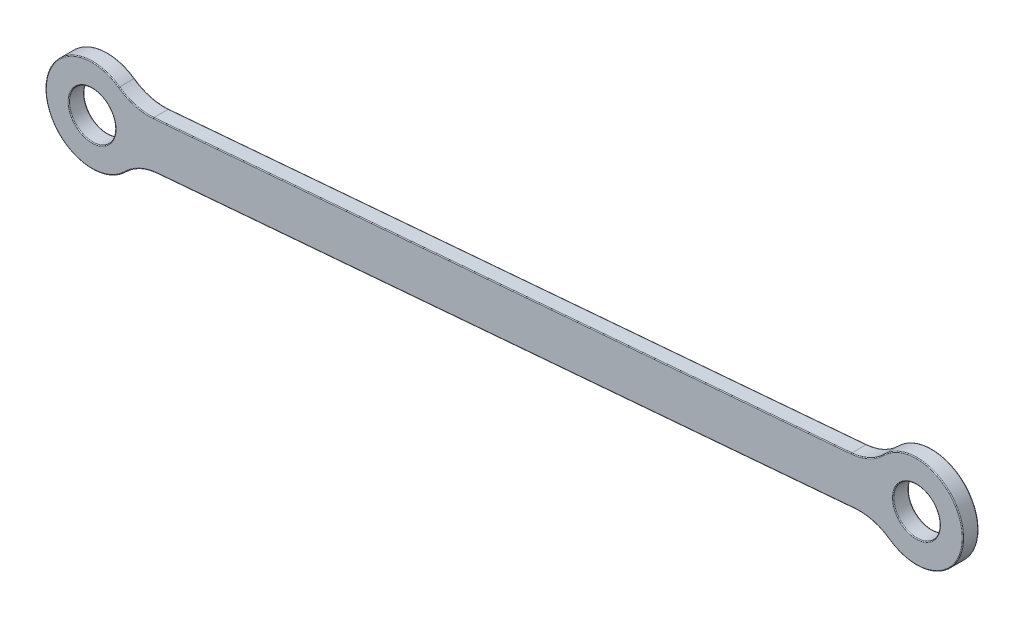
ISO-10303-21;
HEADER;
FILE_DESCRIPTION(('STEP AP214'),'2;1');
FILE_NAME('part.step','',(''),(''),'','','');
FILE_SCHEMA(('AUTOMOTIVE_DESIGN { 1 0 10303 214 1 1 1 1 }'));
ENDSEC;
DATA;
#1=APPLICATION_CONTEXT('core data for automotive mechanical design processes');
#2=APPLICATION_PROTOCOL_DEFINITION('international standard','automotive_design',2000,#1);
#3=PRODUCT_CONTEXT('',#1,'mechanical');
#4=PRODUCT('Part','Part','',(#3));
#5=PRODUCT_RELATED_PRODUCT_CATEGORY('part','',(#4));
#6=PRODUCT_DEFINITION_FORMATION('','',#4);
#7=PRODUCT_DEFINITION_CONTEXT('part definition',#1,'design');
#8=PRODUCT_DEFINITION('design','',#6,#7);
#9=PRODUCT_DEFINITION_SHAPE('','',#8);
#10=(LENGTH_UNIT() NAMED_UNIT(*) SI_UNIT(.MILLI.,.METRE.));
#11=(NAMED_UNIT(*) PLANE_ANGLE_UNIT() SI_UNIT($,.RADIAN.));
#12=(NAMED_UNIT(*) SI_UNIT($,.STERADIAN.) SOLID_ANGLE_UNIT());
#13=UNCERTAINTY_MEASURE_WITH_UNIT(LENGTH_MEASURE(1.E-05),#10,'distance_accuracy_value','');
#14=(GEOMETRIC_REPRESENTATION_CONTEXT(3) GLOBAL_UNCERTAINTY_ASSIGNED_CONTEXT((#13)) GLOBAL_UNIT_ASSIGNED_CONTEXT((#10,
#11,#12)) REPRESENTATION_CONTEXT('',''));
#15=CARTESIAN_POINT('',(0.,0.,0.));
#16=DIRECTION('',(0.,0.,1.));
#17=DIRECTION('',(1.,0.,0.));
#18=AXIS2_PLACEMENT_3D('',#15,#16,#17);
#19=CARTESIAN_POINT('',(-86.9250550920699,226.277353864385,3.));
#20=DIRECTION('',(0.,0.,-1.));
#21=DIRECTION('',(-1.,0.,0.));
#22=AXIS2_PLACEMENT_3D('',#19,#20,#21);
#23=CYLINDRICAL_SURFACE('',#22,9.);
#24=DIRECTION('',(0.,0.,-1.));
#25=VECTOR('',#24,1.);
#26=CARTESIAN_POINT('',(-92.146757938512,218.947018307027,3.));
#27=LINE('',#26,#25);
#28=CARTESIAN_POINT('',(-92.146757938512,218.947018307027,2.85));
#29=VERTEX_POINT('',#28);
#30=CARTESIAN_POINT('',(-92.146757938512,218.947018307027,0.15));
#31=VERTEX_POINT('',#30);
#32=EDGE_CURVE('E306',#29,#31,#27,.T.);
#33=ORIENTED_EDGE('',*,*,#32,.T.);
#34=CARTESIAN_POINT('',(-86.9250550920699,226.277353864385,0.15));
#35=DIRECTION('',(0.,0.,1.));
#36=DIRECTION('',(1.,0.,0.));
#37=AXIS2_PLACEMENT_3D('',#34,#35,#36);
#38=CIRCLE('',#37,9.);
#39=CARTESIAN_POINT('',(-93.2944978018195,232.635828490207,0.15));
#40=VERTEX_POINT('',#39);
#41=EDGE_CURVE('E221',#31,#40,#38,.T.);
#42=ORIENTED_EDGE('',*,*,#41,.T.);
#43=DIRECTION('',(0.,0.,-1.));
#44=VECTOR('',#43,1.);
#45=CARTESIAN_POINT('',(-93.2944978018195,232.635828490207,3.));
#46=LINE('',#45,#44);
#47=CARTESIAN_POINT('',(-93.2944978018195,232.635828490207,2.85));
#48=VERTEX_POINT('',#47);
#49=EDGE_CURVE('E300',#40,#48,#46,.F.);
#50=ORIENTED_EDGE('',*,*,#49,.T.);
#51=CARTESIAN_POINT('',(-86.9250550920699,226.277353864385,2.85));
#52=DIRECTION('',(0.,0.,1.));
#53=DIRECTION('',(1.,0.,0.));
#54=AXIS2_PLACEMENT_3D('',#51,#52,#53);
#55=CIRCLE('',#54,9.);
#56=EDGE_CURVE('E219',#48,#29,#55,.F.);
#57=ORIENTED_EDGE('',*,*,#56,.T.);
#58=EDGE_LOOP('',(#33,#42,#50,#57));
#59=FACE_BOUND('',#58,.T.);
#60=ADVANCED_FACE('F35',(#59),#23,.T.);
#61=CARTESIAN_POINT('',(-19.8226080841096,236.419356052479,3.));
#62=DIRECTION('',(-0.0835519440721957,0.996503423296557,0.));
#63=DIRECTION('',(-0.996503423296557,-0.0835519440721958,0.));
#64=AXIS2_PLACEMENT_3D('',#61,#62,#63);
#65=PLANE('',#64);
#66=DIRECTION('',(0.,0.,-1.));
#67=VECTOR('',#66,1.);
#68=CARTESIAN_POINT('',(-99.536136927486,229.735766063709,3.));
#69=LINE('',#68,#67);
#70=CARTESIAN_POINT('',(-99.536136927486,229.735766063709,2.85));
#71=VERTEX_POINT('',#70);
#72=CARTESIAN_POINT('',(-99.536136927486,229.735766063709,0.15));
#73=VERTEX_POINT('',#72);
#74=EDGE_CURVE('E302',#71,#73,#69,.T.);
#75=ORIENTED_EDGE('',*,*,#74,.T.);
#76=DIRECTION('',(0.996503423296557,0.0835519440721958,0.));
#77=VECTOR('',#76,1.);
#78=CARTESIAN_POINT('',(-234.506488480753,218.419161423178,0.15));
#79=LINE('',#78,#77);
#80=CARTESIAN_POINT('',(-234.506488480753,218.419161423178,0.15));
#81=VERTEX_POINT('',#80);
#82=EDGE_CURVE('E196',#73,#81,#79,.F.);
#83=ORIENTED_EDGE('',*,*,#82,.T.);
#84=DIRECTION('',(0.,0.,-1.));
#85=VECTOR('',#84,1.);
#86=CARTESIAN_POINT('',(-234.506488480753,218.419161423178,3.));
#87=LINE('',#86,#85);
#88=CARTESIAN_POINT('',(-234.506488480753,218.419161423178,2.85));
#89=VERTEX_POINT('',#88);
#90=EDGE_CURVE('E338',#81,#89,#87,.F.);
#91=ORIENTED_EDGE('',*,*,#90,.T.);
#92=DIRECTION('',(0.996503423296557,0.0835519440721958,0.));
#93=VECTOR('',#92,1.);
#94=CARTESIAN_POINT('',(-19.8226080841096,236.419356052479,2.85));
#95=LINE('',#94,#93);
#96=EDGE_CURVE('E194',#89,#71,#95,.T.);
#97=ORIENTED_EDGE('',*,*,#96,.T.);
#98=EDGE_LOOP('',(#75,#83,#91,#97));
#99=FACE_BOUND('',#98,.T.);
#100=ADVANCED_FACE('F337',(#99),#65,.T.);
#101=CARTESIAN_POINT('',(-246.365602819519,212.909042812834,3.));
#102=DIRECTION('',(0.,0.,-1.));
#103=DIRECTION('',(-1.,0.,0.));
#104=AXIS2_PLACEMENT_3D('',#101,#102,#103);
#105=CYLINDRICAL_SURFACE('',#104,9.00000000000001);
#106=DIRECTION('',(0.,0.,-1.));
#107=VECTOR('',#106,1.);
#108=CARTESIAN_POINT('',(-241.143899973077,220.239378370191,3.));
#109=LINE('',#108,#107);
#110=CARTESIAN_POINT('',(-241.143899973077,220.239378370191,2.85));
#111=VERTEX_POINT('',#110);
#112=CARTESIAN_POINT('',(-241.143899973077,220.239378370191,0.15));
#113=VERTEX_POINT('',#112);
#114=EDGE_CURVE('E262',#111,#113,#109,.T.);
#115=ORIENTED_EDGE('',*,*,#114,.T.);
#116=CARTESIAN_POINT('',(-246.365602819519,212.909042812834,0.15));
#117=DIRECTION('',(0.,0.,1.));
#118=DIRECTION('',(1.,0.,0.));
#119=AXIS2_PLACEMENT_3D('',#116,#117,#118);
#120=CIRCLE('',#119,9.00000000000001);
#121=CARTESIAN_POINT('',(-239.996160109769,206.550568187012,0.15));
#122=VERTEX_POINT('',#121);
#123=EDGE_CURVE('E204',#113,#122,#120,.T.);
#124=ORIENTED_EDGE('',*,*,#123,.T.);
#125=DIRECTION('',(0.,0.,-1.));
#126=VECTOR('',#125,1.);
#127=CARTESIAN_POINT('',(-239.996160109769,206.550568187012,3.));
#128=LINE('',#127,#126);
#129=CARTESIAN_POINT('',(-239.996160109769,206.550568187012,2.85));
#130=VERTEX_POINT('',#129);
#131=EDGE_CURVE('E310',#122,#130,#128,.F.);
#132=ORIENTED_EDGE('',*,*,#131,.T.);
#133=CARTESIAN_POINT('',(-246.365602819519,212.909042812834,2.85));
#134=DIRECTION('',(0.,0.,1.));
#135=DIRECTION('',(1.,0.,0.));
#136=AXIS2_PLACEMENT_3D('',#133,#134,#135);
#137=CIRCLE('',#136,9.00000000000001);
#138=EDGE_CURVE('E202',#130,#111,#137,.F.);
#139=ORIENTED_EDGE('',*,*,#138,.T.);
#140=EDGE_LOOP('',(#115,#124,#132,#139));
#141=FACE_BOUND('',#140,.T.);
#142=ADVANCED_FACE('F349',(#141),#105,.T.);
#143=CARTESIAN_POINT('',(-19.0706405874598,227.45082524281,3.));
#144=DIRECTION('',(-0.0835519440721957,0.996503423296557,0.));
#145=DIRECTION('',(-0.996503423296557,-0.0835519440721957,0.));
#146=AXIS2_PLACEMENT_3D('',#143,#144,#145);
#147=PLANE('',#146);
#148=DIRECTION('',(0.,0.,1.));
#149=VECTOR('',#148,1.);
#150=CARTESIAN_POINT('',(-233.754520984103,209.450630613509,0.));
#151=LINE('',#150,#149);
#152=CARTESIAN_POINT('',(-233.754520984103,209.450630613509,2.85));
#153=VERTEX_POINT('',#152);
#154=CARTESIAN_POINT('',(-233.754520984103,209.450630613509,0.15));
#155=VERTEX_POINT('',#154);
#156=EDGE_CURVE('E340',#153,#155,#151,.F.);
#157=ORIENTED_EDGE('',*,*,#156,.T.);
#158=DIRECTION('',(0.996503423296557,0.0835519440721957,0.));
#159=VECTOR('',#158,1.);
#160=CARTESIAN_POINT('',(-19.0706405874598,227.45082524281,0.15));
#161=LINE('',#160,#159);
#162=CARTESIAN_POINT('',(-98.7841694308362,220.76723525404,0.15));
#163=VERTEX_POINT('',#162);
#164=EDGE_CURVE('E213',#155,#163,#161,.T.);
#165=ORIENTED_EDGE('',*,*,#164,.T.);
#166=DIRECTION('',(0.,0.,1.));
#167=VECTOR('',#166,1.);
#168=CARTESIAN_POINT('',(-98.7841694308362,220.76723525404,3.));
#169=LINE('',#168,#167);
#170=CARTESIAN_POINT('',(-98.7841694308362,220.76723525404,2.85));
#171=VERTEX_POINT('',#170);
#172=EDGE_CURVE('E308',#163,#171,#169,.T.);
#173=ORIENTED_EDGE('',*,*,#172,.T.);
#174=DIRECTION('',(0.996503423296557,0.0835519440721957,0.));
#175=VECTOR('',#174,1.);
#176=CARTESIAN_POINT('',(-233.754520984103,209.450630613509,2.85));
#177=LINE('',#176,#175);
#178=EDGE_CURVE('E211',#171,#153,#177,.F.);
#179=ORIENTED_EDGE('',*,*,#178,.T.);
#180=EDGE_LOOP('',(#157,#165,#173,#179));
#181=FACE_BOUND('',#180,.T.);
#182=ADVANCED_FACE('F389',(#181),#147,.F.);
#183=CARTESIAN_POINT('',(-86.9250550920699,226.277353864385,3.));
#184=DIRECTION('',(0.,0.,-1.));
#185=DIRECTION('',(-1.,0.,0.));
#186=AXIS2_PLACEMENT_3D('',#183,#184,#185);
#187=CYLINDRICAL_SURFACE('',#186,4.50000000000002);
#188=CARTESIAN_POINT('',(-86.9250550920699,226.277353864385,0.15));
#189=DIRECTION('',(0.,0.,1.));
#190=DIRECTION('',(1.,0.,0.));
#191=AXIS2_PLACEMENT_3D('',#188,#189,#190);
#192=CIRCLE('',#191,4.50000000000002);
#193=CARTESIAN_POINT('',(-82.4250550920699,226.277353864385,0.15));
#194=VERTEX_POINT('',#193);
#195=EDGE_CURVE('E226',#194,#194,#192,.F.);
#196=ORIENTED_EDGE('',*,*,#195,.T.);
#197=EDGE_LOOP('',(#196));
#198=FACE_BOUND('',#197,.T.);
#199=CARTESIAN_POINT('',(-86.9250550920699,226.277353864385,2.85));
#200=DIRECTION('',(0.,0.,1.));
#201=DIRECTION('',(1.,0.,0.));
#202=AXIS2_PLACEMENT_3D('',#199,#200,#201);
#203=CIRCLE('',#202,4.50000000000002);
#204=CARTESIAN_POINT('',(-82.4250550920699,226.277353864385,2.85));
#205=VERTEX_POINT('',#204);
#206=EDGE_CURVE('E223',#205,#205,#203,.T.);
#207=ORIENTED_EDGE('',*,*,#206,.T.);
#208=EDGE_LOOP('',(#207));
#209=FACE_BOUND('',#208,.T.);
#210=ADVANCED_FACE('F385',(#198,#209),#187,.F.);
#211=CARTESIAN_POINT('',(-246.365602819519,212.909042812834,3.));
#212=DIRECTION('',(0.,0.,-1.));
#213=DIRECTION('',(-1.,0.,0.));
#214=AXIS2_PLACEMENT_3D('',#211,#212,#213);
#215=CYLINDRICAL_SURFACE('',#214,4.50000000000004);
#216=CARTESIAN_POINT('',(-246.365602819519,212.909042812834,0.15));
#217=DIRECTION('',(0.,0.,1.));
#218=DIRECTION('',(1.,0.,0.));
#219=AXIS2_PLACEMENT_3D('',#216,#217,#218);
#220=CIRCLE('',#219,4.50000000000004);
#221=CARTESIAN_POINT('',(-241.865602819519,212.909042812834,0.15));
#222=VERTEX_POINT('',#221);
#223=EDGE_CURVE('E188',#222,#222,#220,.F.);
#224=ORIENTED_EDGE('',*,*,#223,.T.);
#225=EDGE_LOOP('',(#224));
#226=FACE_BOUND('',#225,.T.);
#227=CARTESIAN_POINT('',(-246.365602819519,212.909042812834,2.85));
#228=DIRECTION('',(0.,0.,1.));
#229=DIRECTION('',(1.,0.,0.));
#230=AXIS2_PLACEMENT_3D('',#227,#228,#229);
#231=CIRCLE('',#230,4.50000000000004);
#232=CARTESIAN_POINT('',(-241.865602819519,212.909042812834,2.85));
#233=VERTEX_POINT('',#232);
#234=EDGE_CURVE('E180',#233,#233,#231,.T.);
#235=ORIENTED_EDGE('',*,*,#234,.T.);
#236=EDGE_LOOP('',(#235));
#237=FACE_BOUND('',#236,.T.);
#238=ADVANCED_FACE('F388',(#226,#237),#215,.F.);
#239=CARTESIAN_POINT('',(0.,0.,3.));
#240=DIRECTION('',(0.,0.,1.));
#241=DIRECTION('',(1.,0.,0.));
#242=AXIS2_PLACEMENT_3D('',#239,#240,#241);
#243=PLANE('',#242);
#244=CARTESIAN_POINT('',(-246.365602819519,212.909042812834,3.));
#245=DIRECTION('',(0.,0.,1.));
#246=DIRECTION('',(1.,0.,0.));
#247=AXIS2_PLACEMENT_3D('',#244,#245,#246);
#248=CIRCLE('',#247,4.65000000000004);
#249=CARTESIAN_POINT('',(-241.715602819519,212.909042812834,3.));
#250=VERTEX_POINT('',#249);
#251=EDGE_CURVE('E11',#250,#250,#248,.F.);
#252=ORIENTED_EDGE('',*,*,#251,.T.);
#253=EDGE_LOOP('',(#252));
#254=FACE_BOUND('',#253,.T.);
#255=CARTESIAN_POINT('',(-246.365602819519,212.909042812834,3.));
#256=DIRECTION('',(0.,0.,1.));
#257=DIRECTION('',(1.,0.,0.));
#258=AXIS2_PLACEMENT_3D('',#255,#256,#257);
#259=CIRCLE('',#258,8.85000000000001);
#260=CARTESIAN_POINT('',(-241.230928353851,220.117206110902,3.));
#261=VERTEX_POINT('',#260);
#262=CARTESIAN_POINT('',(-240.102317488265,206.656542764109,3.));
#263=VERTEX_POINT('',#262);
#264=EDGE_CURVE('E52',#261,#263,#259,.T.);
#265=ORIENTED_EDGE('',*,*,#264,.T.);
#266=CARTESIAN_POINT('',(-232.919001543381,199.485596380543,3.));
#267=DIRECTION('',(0.,0.,1.));
#268=DIRECTION('',(1.,0.,0.));
#269=AXIS2_PLACEMENT_3D('',#266,#267,#268);
#270=CIRCLE('',#269,10.15);
#271=CARTESIAN_POINT('',(-233.767053775714,209.600106127004,3.));
#272=VERTEX_POINT('',#271);
#273=EDGE_CURVE('E44',#263,#272,#270,.F.);
#274=ORIENTED_EDGE('',*,*,#273,.T.);
#275=DIRECTION('',(0.996503423296557,0.0835519440721957,0.));
#276=VECTOR('',#275,1.);
#277=CARTESIAN_POINT('',(-98.7967022224471,220.916710767535,3.));
#278=LINE('',#277,#276);
#279=CARTESIAN_POINT('',(-98.7967022224471,220.916710767535,3.));
#280=VERTEX_POINT('',#279);
#281=EDGE_CURVE('E232',#272,#280,#278,.T.);
#282=ORIENTED_EDGE('',*,*,#281,.T.);
#283=CARTESIAN_POINT('',(-97.9486499901143,210.802201021075,3.));
#284=DIRECTION('',(0.,0.,1.));
#285=DIRECTION('',(1.,0.,0.));
#286=AXIS2_PLACEMENT_3D('',#283,#284,#285);
#287=CIRCLE('',#286,10.15);
#288=CARTESIAN_POINT('',(-92.0597295577379,219.069190566317,3.));
#289=VERTEX_POINT('',#288);
#290=EDGE_CURVE('E234',#280,#289,#287,.F.);
#291=ORIENTED_EDGE('',*,*,#290,.T.);
#292=CARTESIAN_POINT('',(-86.9250550920699,226.277353864385,3.));
#293=DIRECTION('',(0.,0.,1.));
#294=DIRECTION('',(1.,0.,0.));
#295=AXIS2_PLACEMENT_3D('',#292,#293,#294);
#296=CIRCLE('',#295,8.85);
#297=CARTESIAN_POINT('',(-93.1883404233236,232.52985391311,3.));
#298=VERTEX_POINT('',#297);
#299=EDGE_CURVE('E236',#289,#298,#296,.T.);
#300=ORIENTED_EDGE('',*,*,#299,.T.);
#301=CARTESIAN_POINT('',(-100.371656368208,239.700800296675,3.));
#302=DIRECTION('',(0.,0.,1.));
#303=DIRECTION('',(1.,0.,0.));
#304=AXIS2_PLACEMENT_3D('',#301,#302,#303);
#305=CIRCLE('',#304,10.15);
#306=CARTESIAN_POINT('',(-99.5236041358751,229.586290550215,3.));
#307=VERTEX_POINT('',#306);
#308=EDGE_CURVE('E238',#298,#307,#305,.F.);
#309=ORIENTED_EDGE('',*,*,#308,.T.);
#310=DIRECTION('',(0.996503423296557,0.0835519440721958,0.));
#311=VECTOR('',#310,1.);
#312=CARTESIAN_POINT('',(-19.8100752924988,236.269880538984,3.));
#313=LINE('',#312,#311);
#314=CARTESIAN_POINT('',(-234.493955689142,218.269685909684,3.));
#315=VERTEX_POINT('',#314);
#316=EDGE_CURVE('E240',#307,#315,#313,.F.);
#317=ORIENTED_EDGE('',*,*,#316,.T.);
#318=CARTESIAN_POINT('',(-235.342007921475,228.384195656144,3.));
#319=DIRECTION('',(0.,0.,1.));
#320=DIRECTION('',(1.,0.,0.));
#321=AXIS2_PLACEMENT_3D('',#318,#319,#320);
#322=CIRCLE('',#321,10.15);
#323=EDGE_CURVE('E57',#315,#261,#322,.F.);
#324=ORIENTED_EDGE('',*,*,#323,.T.);
#325=EDGE_LOOP('',(#265,#274,#282,#291,#300,#309,#317,#324));
#326=FACE_BOUND('',#325,.T.);
#327=CARTESIAN_POINT('',(-86.9250550920699,226.277353864385,3.));
#328=DIRECTION('',(0.,0.,1.));
#329=DIRECTION('',(1.,0.,0.));
#330=AXIS2_PLACEMENT_3D('',#327,#328,#329);
#331=CIRCLE('',#330,4.65000000000002);
#332=CARTESIAN_POINT('',(-82.2750550920699,226.277353864385,3.));
#333=VERTEX_POINT('',#332);
#334=EDGE_CURVE('E229',#333,#333,#331,.F.);
#335=ORIENTED_EDGE('',*,*,#334,.T.);
#336=EDGE_LOOP('',(#335));
#337=FACE_BOUND('',#336,.T.);
#338=ADVANCED_FACE('F594',(#254,#326,#337),#243,.T.);
#339=CARTESIAN_POINT('',(0.,0.,0.));
#340=DIRECTION('',(0.,0.,1.));
#341=DIRECTION('',(1.,0.,0.));
#342=AXIS2_PLACEMENT_3D('',#339,#340,#341);
#343=PLANE('',#342);
#344=CARTESIAN_POINT('',(-246.365602819519,212.909042812834,0.));
#345=DIRECTION('',(0.,0.,1.));
#346=DIRECTION('',(1.,0.,0.));
#347=AXIS2_PLACEMENT_3D('',#344,#345,#346);
#348=CIRCLE('',#347,4.65000000000004);
#349=CARTESIAN_POINT('',(-241.715602819519,212.909042812834,0.));
#350=VERTEX_POINT('',#349);
#351=EDGE_CURVE('E177',#350,#350,#348,.T.);
#352=ORIENTED_EDGE('',*,*,#351,.T.);
#353=EDGE_LOOP('',(#352));
#354=FACE_BOUND('',#353,.T.);
#355=DIRECTION('',(0.996503423296557,0.0835519440721958,0.));
#356=VECTOR('',#355,1.);
#357=CARTESIAN_POINT('',(-99.5236041358752,229.586290550215,0.));
#358=LINE('',#357,#356);
#359=CARTESIAN_POINT('',(-234.493955689142,218.269685909684,0.));
#360=VERTEX_POINT('',#359);
#361=CARTESIAN_POINT('',(-99.5236041358751,229.586290550215,0.));
#362=VERTEX_POINT('',#361);
#363=EDGE_CURVE('E175',#360,#362,#358,.T.);
#364=ORIENTED_EDGE('',*,*,#363,.T.);
#365=CARTESIAN_POINT('',(-100.371656368208,239.700800296675,0.));
#366=DIRECTION('',(0.,0.,1.));
#367=DIRECTION('',(1.,0.,0.));
#368=AXIS2_PLACEMENT_3D('',#365,#366,#367);
#369=CIRCLE('',#368,10.15);
#370=CARTESIAN_POINT('',(-93.1883404233236,232.52985391311,0.));
#371=VERTEX_POINT('',#370);
#372=EDGE_CURVE('E155',#362,#371,#369,.T.);
#373=ORIENTED_EDGE('',*,*,#372,.T.);
#374=CARTESIAN_POINT('',(-86.9250550920699,226.277353864385,0.));
#375=DIRECTION('',(0.,0.,1.));
#376=DIRECTION('',(1.,0.,0.));
#377=AXIS2_PLACEMENT_3D('',#374,#375,#376);
#378=CIRCLE('',#377,8.85);
#379=CARTESIAN_POINT('',(-92.0597295577379,219.069190566317,0.));
#380=VERTEX_POINT('',#379);
#381=EDGE_CURVE('E163',#371,#380,#378,.F.);
#382=ORIENTED_EDGE('',*,*,#381,.T.);
#383=CARTESIAN_POINT('',(-97.9486499901143,210.802201021075,0.));
#384=DIRECTION('',(0.,0.,1.));
#385=DIRECTION('',(1.,0.,0.));
#386=AXIS2_PLACEMENT_3D('',#383,#384,#385);
#387=CIRCLE('',#386,10.15);
#388=CARTESIAN_POINT('',(-98.7967022224471,220.916710767535,0.));
#389=VERTEX_POINT('',#388);
#390=EDGE_CURVE('E169',#380,#389,#387,.T.);
#391=ORIENTED_EDGE('',*,*,#390,.T.);
#392=DIRECTION('',(0.996503423296557,0.0835519440721957,0.));
#393=VECTOR('',#392,1.);
#394=CARTESIAN_POINT('',(-19.0831733790707,227.600300756304,0.));
#395=LINE('',#394,#393);
#396=CARTESIAN_POINT('',(-233.767053775714,209.600106127004,0.));
#397=VERTEX_POINT('',#396);
#398=EDGE_CURVE('E319',#389,#397,#395,.F.);
#399=ORIENTED_EDGE('',*,*,#398,.T.);
#400=CARTESIAN_POINT('',(-232.919001543381,199.485596380543,0.));
#401=DIRECTION('',(0.,0.,1.));
#402=DIRECTION('',(1.,0.,0.));
#403=AXIS2_PLACEMENT_3D('',#400,#401,#402);
#404=CIRCLE('',#403,10.15);
#405=CARTESIAN_POINT('',(-240.102317488265,206.656542764109,0.));
#406=VERTEX_POINT('',#405);
#407=EDGE_CURVE('E321',#397,#406,#404,.T.);
#408=ORIENTED_EDGE('',*,*,#407,.T.);
#409=CARTESIAN_POINT('',(-246.365602819519,212.909042812834,0.));
#410=DIRECTION('',(0.,0.,1.));
#411=DIRECTION('',(1.,0.,0.));
#412=AXIS2_PLACEMENT_3D('',#409,#410,#411);
#413=CIRCLE('',#412,8.85000000000001);
#414=CARTESIAN_POINT('',(-241.230928353851,220.117206110902,0.));
#415=VERTEX_POINT('',#414);
#416=EDGE_CURVE('E323',#406,#415,#413,.F.);
#417=ORIENTED_EDGE('',*,*,#416,.T.);
#418=CARTESIAN_POINT('',(-235.342007921475,228.384195656144,0.));
#419=DIRECTION('',(0.,0.,1.));
#420=DIRECTION('',(1.,0.,0.));
#421=AXIS2_PLACEMENT_3D('',#418,#419,#420);
#422=CIRCLE('',#421,10.15);
#423=EDGE_CURVE('E182',#415,#360,#422,.T.);
#424=ORIENTED_EDGE('',*,*,#423,.T.);
#425=EDGE_LOOP('',(#364,#373,#382,#391,#399,#408,#417,#424));
#426=FACE_BOUND('',#425,.T.);
#427=CARTESIAN_POINT('',(-86.9250550920699,226.277353864385,0.));
#428=DIRECTION('',(0.,0.,1.));
#429=DIRECTION('',(1.,0.,0.));
#430=AXIS2_PLACEMENT_3D('',#427,#428,#429);
#431=CIRCLE('',#430,4.65000000000002);
#432=CARTESIAN_POINT('',(-82.2750550920699,226.277353864385,0.));
#433=VERTEX_POINT('',#432);
#434=EDGE_CURVE('E170',#433,#433,#431,.T.);
#435=ORIENTED_EDGE('',*,*,#434,.T.);
#436=EDGE_LOOP('',(#435));
#437=FACE_BOUND('',#436,.T.);
#438=ADVANCED_FACE('F172',(#354,#426,#437),#343,.F.);
#439=CARTESIAN_POINT('',(-235.342007921475,228.384195656144,3.));
#440=DIRECTION('',(0.,0.,-1.));
#441=DIRECTION('',(-1.,0.,0.));
#442=AXIS2_PLACEMENT_3D('',#439,#440,#441);
#443=CYLINDRICAL_SURFACE('',#442,10.);
#444=ORIENTED_EDGE('',*,*,#90,.F.);
#445=CARTESIAN_POINT('',(-235.342007921475,228.384195656144,0.15));
#446=DIRECTION('',(0.,0.,1.));
#447=DIRECTION('',(1.,0.,0.));
#448=AXIS2_PLACEMENT_3D('',#445,#446,#447);
#449=CIRCLE('',#448,10.);
#450=EDGE_CURVE('E200',#81,#113,#449,.F.);
#451=ORIENTED_EDGE('',*,*,#450,.T.);
#452=ORIENTED_EDGE('',*,*,#114,.F.);
#453=CARTESIAN_POINT('',(-235.342007921475,228.384195656144,2.85));
#454=DIRECTION('',(0.,0.,1.));
#455=DIRECTION('',(1.,0.,0.));
#456=AXIS2_PLACEMENT_3D('',#453,#454,#455);
#457=CIRCLE('',#456,10.);
#458=EDGE_CURVE('E198',#111,#89,#457,.T.);
#459=ORIENTED_EDGE('',*,*,#458,.T.);
#460=EDGE_LOOP('',(#444,#451,#452,#459));
#461=FACE_BOUND('',#460,.T.);
#462=ADVANCED_FACE('F391',(#461),#443,.F.);
#463=CARTESIAN_POINT('',(-232.919001543381,199.485596380543,3.));
#464=DIRECTION('',(0.,0.,-1.));
#465=DIRECTION('',(-1.,0.,0.));
#466=AXIS2_PLACEMENT_3D('',#463,#464,#465);
#467=CYLINDRICAL_SURFACE('',#466,10.);
#468=ORIENTED_EDGE('',*,*,#131,.F.);
#469=CARTESIAN_POINT('',(-232.919001543381,199.485596380543,0.15));
#470=DIRECTION('',(0.,0.,1.));
#471=DIRECTION('',(1.,0.,0.));
#472=AXIS2_PLACEMENT_3D('',#469,#470,#471);
#473=CIRCLE('',#472,10.);
#474=EDGE_CURVE('E209',#122,#155,#473,.F.);
#475=ORIENTED_EDGE('',*,*,#474,.T.);
#476=ORIENTED_EDGE('',*,*,#156,.F.);
#477=CARTESIAN_POINT('',(-232.919001543381,199.485596380543,2.85));
#478=DIRECTION('',(0.,0.,1.));
#479=DIRECTION('',(1.,0.,0.));
#480=AXIS2_PLACEMENT_3D('',#477,#478,#479);
#481=CIRCLE('',#480,10.);
#482=EDGE_CURVE('E206',#153,#130,#481,.T.);
#483=ORIENTED_EDGE('',*,*,#482,.T.);
#484=EDGE_LOOP('',(#468,#475,#476,#483));
#485=FACE_BOUND('',#484,.T.);
#486=ADVANCED_FACE('F355',(#485),#467,.F.);
#487=CARTESIAN_POINT('',(-100.371656368208,239.700800296675,3.));
#488=DIRECTION('',(0.,0.,-1.));
#489=DIRECTION('',(-1.,0.,0.));
#490=AXIS2_PLACEMENT_3D('',#487,#488,#489);
#491=CYLINDRICAL_SURFACE('',#490,10.);
#492=ORIENTED_EDGE('',*,*,#49,.F.);
#493=CARTESIAN_POINT('',(-100.371656368208,239.700800296675,0.15));
#494=DIRECTION('',(0.,0.,1.));
#495=DIRECTION('',(1.,0.,0.));
#496=AXIS2_PLACEMENT_3D('',#493,#494,#495);
#497=CIRCLE('',#496,10.);
#498=EDGE_CURVE('E157',#40,#73,#497,.F.);
#499=ORIENTED_EDGE('',*,*,#498,.T.);
#500=ORIENTED_EDGE('',*,*,#74,.F.);
#501=CARTESIAN_POINT('',(-100.371656368208,239.700800296675,2.85));
#502=DIRECTION('',(0.,0.,1.));
#503=DIRECTION('',(1.,0.,0.));
#504=AXIS2_PLACEMENT_3D('',#501,#502,#503);
#505=CIRCLE('',#504,10.);
#506=EDGE_CURVE('E191',#71,#48,#505,.T.);
#507=ORIENTED_EDGE('',*,*,#506,.T.);
#508=EDGE_LOOP('',(#492,#499,#500,#507));
#509=FACE_BOUND('',#508,.T.);
#510=ADVANCED_FACE('F299',(#509),#491,.F.);
#511=CARTESIAN_POINT('',(-97.9486499901143,210.802201021075,3.));
#512=DIRECTION('',(0.,0.,-1.));
#513=DIRECTION('',(-1.,0.,0.));
#514=AXIS2_PLACEMENT_3D('',#511,#512,#513);
#515=CYLINDRICAL_SURFACE('',#514,10.);
#516=ORIENTED_EDGE('',*,*,#172,.F.);
#517=CARTESIAN_POINT('',(-97.9486499901143,210.802201021075,0.15));
#518=DIRECTION('',(0.,0.,1.));
#519=DIRECTION('',(1.,0.,0.));
#520=AXIS2_PLACEMENT_3D('',#517,#518,#519);
#521=CIRCLE('',#520,10.);
#522=EDGE_CURVE('E217',#163,#31,#521,.F.);
#523=ORIENTED_EDGE('',*,*,#522,.T.);
#524=ORIENTED_EDGE('',*,*,#32,.F.);
#525=CARTESIAN_POINT('',(-97.9486499901143,210.802201021075,2.85));
#526=DIRECTION('',(0.,0.,1.));
#527=DIRECTION('',(1.,0.,0.));
#528=AXIS2_PLACEMENT_3D('',#525,#526,#527);
#529=CIRCLE('',#528,10.);
#530=EDGE_CURVE('E215',#29,#171,#529,.T.);
#531=ORIENTED_EDGE('',*,*,#530,.T.);
#532=EDGE_LOOP('',(#516,#523,#524,#531));
#533=FACE_BOUND('',#532,.T.);
#534=ADVANCED_FACE('F398',(#533),#515,.F.);
#535=CARTESIAN_POINT('',(-246.365602819519,212.909042812834,0.15));
#536=DIRECTION('',(0.,0.,1.));
#537=DIRECTION('',(1.,0.,0.));
#538=AXIS2_PLACEMENT_3D('',#535,#536,#537);
#539=TOROIDAL_SURFACE('',#538,4.65000000000004,0.15);
#540=ORIENTED_EDGE('',*,*,#223,.F.);
#541=EDGE_LOOP('',(#540));
#542=FACE_BOUND('',#541,.T.);
#543=ORIENTED_EDGE('',*,*,#351,.F.);
#544=EDGE_LOOP('',(#543));
#545=FACE_BOUND('',#544,.T.);
#546=ADVANCED_FACE('F375',(#542,#545),#539,.T.);
#547=CARTESIAN_POINT('',(-232.919001543381,199.485596380543,0.15));
#548=DIRECTION('',(0.,0.,1.));
#549=DIRECTION('',(1.,0.,0.));
#550=AXIS2_PLACEMENT_3D('',#547,#548,#549);
#551=TOROIDAL_SURFACE('',#550,10.15,0.15);
#552=CARTESIAN_POINT('',(-233.767053775714,209.600106127004,0.15));
#553=DIRECTION('',(0.99650342329655,0.0835519440722817,0.));
#554=DIRECTION('',(-0.0835519440722817,0.99650342329655,0.));
#555=AXIS2_PLACEMENT_3D('',#552,#553,#554);
#556=CIRCLE('',#555,0.15);
#557=EDGE_CURVE('E256',#155,#397,#556,.T.);
#558=ORIENTED_EDGE('',*,*,#557,.F.);
#559=ORIENTED_EDGE('',*,*,#474,.F.);
#560=CARTESIAN_POINT('',(-240.102317488265,206.656542764109,0.15));
#561=DIRECTION('',(-0.706497180646861,-0.707715856638833,0.));
#562=DIRECTION('',(0.707715856638833,-0.706497180646861,0.));
#563=AXIS2_PLACEMENT_3D('',#560,#561,#562);
#564=CIRCLE('',#563,0.15);
#565=EDGE_CURVE('E259',#406,#122,#564,.T.);
#566=ORIENTED_EDGE('',*,*,#565,.F.);
#567=ORIENTED_EDGE('',*,*,#407,.F.);
#568=EDGE_LOOP('',(#558,#559,#566,#567));
#569=FACE_BOUND('',#568,.T.);
#570=ADVANCED_FACE('F361',(#569),#551,.T.);
#571=CARTESIAN_POINT('',(-246.365602819519,212.909042812834,0.15));
#572=DIRECTION('',(0.,0.,1.));
#573=DIRECTION('',(1.,0.,0.));
#574=AXIS2_PLACEMENT_3D('',#571,#572,#573);
#575=TOROIDAL_SURFACE('',#574,8.85000000000001,0.15);
#576=ORIENTED_EDGE('',*,*,#565,.T.);
#577=ORIENTED_EDGE('',*,*,#123,.F.);
#578=CARTESIAN_POINT('',(-241.230928353851,220.117206110902,0.15));
#579=DIRECTION('',(0.814481728595248,-0.580189205160263,0.));
#580=DIRECTION('',(0.580189205160263,0.814481728595248,0.));
#581=AXIS2_PLACEMENT_3D('',#578,#579,#580);
#582=CIRCLE('',#581,0.15);
#583=EDGE_CURVE('E253',#415,#113,#582,.T.);
#584=ORIENTED_EDGE('',*,*,#583,.F.);
#585=ORIENTED_EDGE('',*,*,#416,.F.);
#586=EDGE_LOOP('',(#576,#577,#584,#585));
#587=FACE_BOUND('',#586,.T.);
#588=ADVANCED_FACE('F365',(#587),#575,.T.);
#589=CARTESIAN_POINT('',(-19.0831733790707,227.600300756304,0.15));
#590=DIRECTION('',(0.996503423296557,0.0835519440721957,0.));
#591=DIRECTION('',(-0.0835519440721957,0.996503423296557,0.));
#592=AXIS2_PLACEMENT_3D('',#589,#590,#591);
#593=CYLINDRICAL_SURFACE('',#592,0.15);
#594=ORIENTED_EDGE('',*,*,#557,.T.);
#595=ORIENTED_EDGE('',*,*,#398,.F.);
#596=CARTESIAN_POINT('',(-98.7967022224471,220.916710767535,0.15));
#597=DIRECTION('',(0.996503423296558,0.0835519440721898,0.));
#598=DIRECTION('',(-0.0835519440721898,0.996503423296557,0.));
#599=AXIS2_PLACEMENT_3D('',#596,#597,#598);
#600=CIRCLE('',#599,0.15);
#601=EDGE_CURVE('E250',#163,#389,#600,.T.);
#602=ORIENTED_EDGE('',*,*,#601,.F.);
#603=ORIENTED_EDGE('',*,*,#164,.F.);
#604=EDGE_LOOP('',(#594,#595,#602,#603));
#605=FACE_BOUND('',#604,.T.);
#606=ADVANCED_FACE('F367',(#605),#593,.T.);
#607=CARTESIAN_POINT('',(-235.342007921475,228.384195656144,0.15));
#608=DIRECTION('',(0.,0.,1.));
#609=DIRECTION('',(1.,0.,0.));
#610=AXIS2_PLACEMENT_3D('',#607,#608,#609);
#611=TOROIDAL_SURFACE('',#610,10.15,0.15);
#612=ORIENTED_EDGE('',*,*,#583,.T.);
#613=ORIENTED_EDGE('',*,*,#450,.F.);
#614=CARTESIAN_POINT('',(-234.493955689142,218.269685909684,0.15));
#615=DIRECTION('',(0.99650342329655,0.0835519440722816,0.));
#616=DIRECTION('',(-0.0835519440722817,0.99650342329655,0.));
#617=AXIS2_PLACEMENT_3D('',#614,#615,#616);
#618=CIRCLE('',#617,0.15);
#619=EDGE_CURVE('E247',#360,#81,#618,.T.);
#620=ORIENTED_EDGE('',*,*,#619,.F.);
#621=ORIENTED_EDGE('',*,*,#423,.F.);
#622=EDGE_LOOP('',(#612,#613,#620,#621));
#623=FACE_BOUND('',#622,.T.);
#624=ADVANCED_FACE('F330',(#623),#611,.T.);
#625=CARTESIAN_POINT('',(-97.9486499901143,210.802201021075,0.15));
#626=DIRECTION('',(0.,0.,1.));
#627=DIRECTION('',(1.,0.,0.));
#628=AXIS2_PLACEMENT_3D('',#625,#626,#627);
#629=TOROIDAL_SURFACE('',#628,10.15,0.15);
#630=ORIENTED_EDGE('',*,*,#601,.T.);
#631=ORIENTED_EDGE('',*,*,#390,.F.);
#632=CARTESIAN_POINT('',(-92.0597295577379,219.069190566317,0.15));
#633=DIRECTION('',(0.814481728595248,-0.580189205160263,0.));
#634=DIRECTION('',(0.580189205160263,0.814481728595248,0.));
#635=AXIS2_PLACEMENT_3D('',#632,#633,#634);
#636=CIRCLE('',#635,0.15);
#637=EDGE_CURVE('E166',#31,#380,#636,.T.);
#638=ORIENTED_EDGE('',*,*,#637,.F.);
#639=ORIENTED_EDGE('',*,*,#522,.F.);
#640=EDGE_LOOP('',(#630,#631,#638,#639));
#641=FACE_BOUND('',#640,.T.);
#642=ADVANCED_FACE('F412',(#641),#629,.T.);
#643=CARTESIAN_POINT('',(-19.8100752924988,236.269880538984,0.15));
#644=DIRECTION('',(-0.996503423296557,-0.0835519440721958,0.));
#645=DIRECTION('',(0.0835519440721958,-0.996503423296557,0.));
#646=AXIS2_PLACEMENT_3D('',#643,#644,#645);
#647=CYLINDRICAL_SURFACE('',#646,0.15);
#648=ORIENTED_EDGE('',*,*,#619,.T.);
#649=ORIENTED_EDGE('',*,*,#82,.F.);
#650=CARTESIAN_POINT('',(-99.5236041358751,229.586290550215,0.15));
#651=DIRECTION('',(0.996503423296556,0.0835519440722052,0.));
#652=DIRECTION('',(-0.0835519440722052,0.996503423296556,0.));
#653=AXIS2_PLACEMENT_3D('',#650,#651,#652);
#654=CIRCLE('',#653,0.15);
#655=EDGE_CURVE('E160',#362,#73,#654,.T.);
#656=ORIENTED_EDGE('',*,*,#655,.F.);
#657=ORIENTED_EDGE('',*,*,#363,.F.);
#658=EDGE_LOOP('',(#648,#649,#656,#657));
#659=FACE_BOUND('',#658,.T.);
#660=ADVANCED_FACE('F333',(#659),#647,.T.);
#661=CARTESIAN_POINT('',(-86.9250550920699,226.277353864385,0.15));
#662=DIRECTION('',(0.,0.,1.));
#663=DIRECTION('',(1.,0.,0.));
#664=AXIS2_PLACEMENT_3D('',#661,#662,#663);
#665=TOROIDAL_SURFACE('',#664,8.85,0.15);
#666=ORIENTED_EDGE('',*,*,#637,.T.);
#667=ORIENTED_EDGE('',*,*,#381,.F.);
#668=CARTESIAN_POINT('',(-93.1883404233237,232.52985391311,0.15));
#669=DIRECTION('',(-0.706497180646814,-0.707715856638879,0.));
#670=DIRECTION('',(0.707715856638879,-0.706497180646814,0.));
#671=AXIS2_PLACEMENT_3D('',#668,#669,#670);
#672=CIRCLE('',#671,0.15);
#673=EDGE_CURVE('E151',#40,#371,#672,.T.);
#674=ORIENTED_EDGE('',*,*,#673,.F.);
#675=ORIENTED_EDGE('',*,*,#41,.F.);
#676=EDGE_LOOP('',(#666,#667,#674,#675));
#677=FACE_BOUND('',#676,.T.);
#678=ADVANCED_FACE('F164',(#677),#665,.T.);
#679=CARTESIAN_POINT('',(-100.371656368208,239.700800296675,0.15));
#680=DIRECTION('',(0.,0.,1.));
#681=DIRECTION('',(1.,0.,0.));
#682=AXIS2_PLACEMENT_3D('',#679,#680,#681);
#683=TOROIDAL_SURFACE('',#682,10.15,0.15);
#684=ORIENTED_EDGE('',*,*,#655,.T.);
#685=ORIENTED_EDGE('',*,*,#498,.F.);
#686=ORIENTED_EDGE('',*,*,#673,.T.);
#687=ORIENTED_EDGE('',*,*,#372,.F.);
#688=EDGE_LOOP('',(#684,#685,#686,#687));
#689=FACE_BOUND('',#688,.T.);
#690=ADVANCED_FACE('F153',(#689),#683,.T.);
#691=CARTESIAN_POINT('',(-86.9250550920699,226.277353864385,0.15));
#692=DIRECTION('',(0.,0.,1.));
#693=DIRECTION('',(1.,0.,0.));
#694=AXIS2_PLACEMENT_3D('',#691,#692,#693);
#695=TOROIDAL_SURFACE('',#694,4.65000000000002,0.15);
#696=ORIENTED_EDGE('',*,*,#195,.F.);
#697=EDGE_LOOP('',(#696));
#698=FACE_BOUND('',#697,.T.);
#699=ORIENTED_EDGE('',*,*,#434,.F.);
#700=EDGE_LOOP('',(#699));
#701=FACE_BOUND('',#700,.T.);
#702=ADVANCED_FACE('F407',(#698,#701),#695,.T.);
#703=CARTESIAN_POINT('',(-246.365602819519,212.909042812834,2.85));
#704=DIRECTION('',(0.,0.,1.));
#705=DIRECTION('',(1.,0.,0.));
#706=AXIS2_PLACEMENT_3D('',#703,#704,#705);
#707=TOROIDAL_SURFACE('',#706,4.65000000000004,0.15);
#708=ORIENTED_EDGE('',*,*,#251,.F.);
#709=EDGE_LOOP('',(#708));
#710=FACE_BOUND('',#709,.T.);
#711=ORIENTED_EDGE('',*,*,#234,.F.);
#712=EDGE_LOOP('',(#711));
#713=FACE_BOUND('',#712,.T.);
#714=ADVANCED_FACE('F443',(#710,#713),#707,.T.);
#715=CARTESIAN_POINT('',(-100.371656368208,239.700800296675,2.85));
#716=DIRECTION('',(0.,0.,1.));
#717=DIRECTION('',(1.,0.,0.));
#718=AXIS2_PLACEMENT_3D('',#715,#716,#717);
#719=TOROIDAL_SURFACE('',#718,10.15,0.15);
#720=CARTESIAN_POINT('',(-93.1883404233237,232.52985391311,2.85));
#721=DIRECTION('',(0.706497180646814,0.707715856638879,0.));
#722=DIRECTION('',(-0.707715856638879,0.706497180646814,0.));
#723=AXIS2_PLACEMENT_3D('',#720,#721,#722);
#724=CIRCLE('',#723,0.15);
#725=EDGE_CURVE('E278',#48,#298,#724,.T.);
#726=ORIENTED_EDGE('',*,*,#725,.F.);
#727=ORIENTED_EDGE('',*,*,#506,.F.);
#728=CARTESIAN_POINT('',(-99.5236041358751,229.586290550215,2.85));
#729=DIRECTION('',(-0.996503423296558,-0.0835519440721898,0.));
#730=DIRECTION('',(0.0835519440721898,-0.996503423296557,0.));
#731=AXIS2_PLACEMENT_3D('',#728,#729,#730);
#732=CIRCLE('',#731,0.15);
#733=EDGE_CURVE('E39',#307,#71,#732,.T.);
#734=ORIENTED_EDGE('',*,*,#733,.F.);
#735=ORIENTED_EDGE('',*,*,#308,.F.);
#736=EDGE_LOOP('',(#726,#727,#734,#735));
#737=FACE_BOUND('',#736,.T.);
#738=ADVANCED_FACE('F294',(#737),#719,.T.);
#739=CARTESIAN_POINT('',(-19.8100752924988,236.269880538984,2.85));
#740=DIRECTION('',(0.996503423296557,0.0835519440721958,0.));
#741=DIRECTION('',(-0.0835519440721958,0.996503423296557,0.));
#742=AXIS2_PLACEMENT_3D('',#739,#740,#741);
#743=CYLINDRICAL_SURFACE('',#742,0.15);
#744=ORIENTED_EDGE('',*,*,#733,.T.);
#745=ORIENTED_EDGE('',*,*,#96,.F.);
#746=CARTESIAN_POINT('',(-234.493955689142,218.269685909684,2.85));
#747=DIRECTION('',(-0.99650342329655,-0.0835519440722817,0.));
#748=DIRECTION('',(0.0835519440722817,-0.99650342329655,0.));
#749=AXIS2_PLACEMENT_3D('',#746,#747,#748);
#750=CIRCLE('',#749,0.15);
#751=EDGE_CURVE('E276',#315,#89,#750,.T.);
#752=ORIENTED_EDGE('',*,*,#751,.F.);
#753=ORIENTED_EDGE('',*,*,#316,.F.);
#754=EDGE_LOOP('',(#744,#745,#752,#753));
#755=FACE_BOUND('',#754,.T.);
#756=ADVANCED_FACE('F289',(#755),#743,.T.);
#757=CARTESIAN_POINT('',(-86.9250550920699,226.277353864385,2.85));
#758=DIRECTION('',(0.,0.,1.));
#759=DIRECTION('',(1.,0.,0.));
#760=AXIS2_PLACEMENT_3D('',#757,#758,#759);
#761=TOROIDAL_SURFACE('',#760,8.85,0.15);
#762=ORIENTED_EDGE('',*,*,#725,.T.);
#763=ORIENTED_EDGE('',*,*,#299,.F.);
#764=CARTESIAN_POINT('',(-92.0597295577379,219.069190566317,2.85));
#765=DIRECTION('',(-0.814481728595248,0.580189205160263,0.));
#766=DIRECTION('',(-0.580189205160263,-0.814481728595248,0.));
#767=AXIS2_PLACEMENT_3D('',#764,#765,#766);
#768=CIRCLE('',#767,0.15);
#769=EDGE_CURVE('E273',#29,#289,#768,.T.);
#770=ORIENTED_EDGE('',*,*,#769,.F.);
#771=ORIENTED_EDGE('',*,*,#56,.F.);
#772=EDGE_LOOP('',(#762,#763,#770,#771));
#773=FACE_BOUND('',#772,.T.);
#774=ADVANCED_FACE('F463',(#773),#761,.T.);
#775=CARTESIAN_POINT('',(-235.342007921475,228.384195656144,2.85));
#776=DIRECTION('',(0.,0.,1.));
#777=DIRECTION('',(1.,0.,0.));
#778=AXIS2_PLACEMENT_3D('',#775,#776,#777);
#779=TOROIDAL_SURFACE('',#778,10.15,0.15);
#780=ORIENTED_EDGE('',*,*,#751,.T.);
#781=ORIENTED_EDGE('',*,*,#458,.F.);
#782=CARTESIAN_POINT('',(-241.230928353851,220.117206110902,2.85));
#783=DIRECTION('',(-0.814481728595248,0.580189205160263,0.));
#784=DIRECTION('',(-0.580189205160263,-0.814481728595248,0.));
#785=AXIS2_PLACEMENT_3D('',#782,#783,#784);
#786=CIRCLE('',#785,0.15);
#787=EDGE_CURVE('E270',#261,#111,#786,.T.);
#788=ORIENTED_EDGE('',*,*,#787,.F.);
#789=ORIENTED_EDGE('',*,*,#323,.F.);
#790=EDGE_LOOP('',(#780,#781,#788,#789));
#791=FACE_BOUND('',#790,.T.);
#792=ADVANCED_FACE('F470',(#791),#779,.T.);
#793=CARTESIAN_POINT('',(-97.9486499901143,210.802201021075,2.85));
#794=DIRECTION('',(0.,0.,1.));
#795=DIRECTION('',(1.,0.,0.));
#796=AXIS2_PLACEMENT_3D('',#793,#794,#795);
#797=TOROIDAL_SURFACE('',#796,10.15,0.15);
#798=ORIENTED_EDGE('',*,*,#769,.T.);
#799=ORIENTED_EDGE('',*,*,#290,.F.);
#800=CARTESIAN_POINT('',(-98.7967022224471,220.916710767535,2.85));
#801=DIRECTION('',(-0.996503423296558,-0.0835519440721898,0.));
#802=DIRECTION('',(0.0835519440721898,-0.996503423296557,0.));
#803=AXIS2_PLACEMENT_3D('',#800,#801,#802);
#804=CIRCLE('',#803,0.15);
#805=EDGE_CURVE('E267',#171,#280,#804,.T.);
#806=ORIENTED_EDGE('',*,*,#805,.F.);
#807=ORIENTED_EDGE('',*,*,#530,.F.);
#808=EDGE_LOOP('',(#798,#799,#806,#807));
#809=FACE_BOUND('',#808,.T.);
#810=ADVANCED_FACE('F477',(#809),#797,.T.);
#811=CARTESIAN_POINT('',(-246.365602819519,212.909042812834,2.85));
#812=DIRECTION('',(0.,0.,1.));
#813=DIRECTION('',(1.,0.,0.));
#814=AXIS2_PLACEMENT_3D('',#811,#812,#813);
#815=TOROIDAL_SURFACE('',#814,8.85000000000001,0.15);
#816=ORIENTED_EDGE('',*,*,#787,.T.);
#817=ORIENTED_EDGE('',*,*,#138,.F.);
#818=CARTESIAN_POINT('',(-240.102317488265,206.656542764109,2.85));
#819=DIRECTION('',(0.706497180646861,0.707715856638833,0.));
#820=DIRECTION('',(-0.707715856638833,0.706497180646861,0.));
#821=AXIS2_PLACEMENT_3D('',#818,#819,#820);
#822=CIRCLE('',#821,0.15);
#823=EDGE_CURVE('E265',#263,#130,#822,.T.);
#824=ORIENTED_EDGE('',*,*,#823,.F.);
#825=ORIENTED_EDGE('',*,*,#264,.F.);
#826=EDGE_LOOP('',(#816,#817,#824,#825));
#827=FACE_BOUND('',#826,.T.);
#828=ADVANCED_FACE('F485',(#827),#815,.T.);
#829=CARTESIAN_POINT('',(-19.0831733790707,227.600300756304,2.85));
#830=DIRECTION('',(-0.996503423296557,-0.0835519440721957,0.));
#831=DIRECTION('',(0.0835519440721957,-0.996503423296557,0.));
#832=AXIS2_PLACEMENT_3D('',#829,#830,#831);
#833=CYLINDRICAL_SURFACE('',#832,0.15);
#834=ORIENTED_EDGE('',*,*,#805,.T.);
#835=ORIENTED_EDGE('',*,*,#281,.F.);
#836=CARTESIAN_POINT('',(-233.767053775714,209.600106127004,2.85));
#837=DIRECTION('',(-0.99650342329655,-0.0835519440722817,0.));
#838=DIRECTION('',(0.0835519440722817,-0.99650342329655,0.));
#839=AXIS2_PLACEMENT_3D('',#836,#837,#838);
#840=CIRCLE('',#839,0.15);
#841=EDGE_CURVE('E263',#153,#272,#840,.T.);
#842=ORIENTED_EDGE('',*,*,#841,.F.);
#843=ORIENTED_EDGE('',*,*,#178,.F.);
#844=EDGE_LOOP('',(#834,#835,#842,#843));
#845=FACE_BOUND('',#844,.T.);
#846=ADVANCED_FACE('F493',(#845),#833,.T.);
#847=CARTESIAN_POINT('',(-232.919001543381,199.485596380543,2.85));
#848=DIRECTION('',(0.,0.,1.));
#849=DIRECTION('',(1.,0.,0.));
#850=AXIS2_PLACEMENT_3D('',#847,#848,#849);
#851=TOROIDAL_SURFACE('',#850,10.15,0.15);
#852=ORIENTED_EDGE('',*,*,#823,.T.);
#853=ORIENTED_EDGE('',*,*,#482,.F.);
#854=ORIENTED_EDGE('',*,*,#841,.T.);
#855=ORIENTED_EDGE('',*,*,#273,.F.);
#856=EDGE_LOOP('',(#852,#853,#854,#855));
#857=FACE_BOUND('',#856,.T.);
#858=ADVANCED_FACE('F501',(#857),#851,.T.);
#859=CARTESIAN_POINT('',(-86.9250550920699,226.277353864385,2.85));
#860=DIRECTION('',(0.,0.,1.));
#861=DIRECTION('',(1.,0.,0.));
#862=AXIS2_PLACEMENT_3D('',#859,#860,#861);
#863=TOROIDAL_SURFACE('',#862,4.65000000000002,0.15);
#864=ORIENTED_EDGE('',*,*,#334,.F.);
#865=EDGE_LOOP('',(#864));
#866=FACE_BOUND('',#865,.T.);
#867=ORIENTED_EDGE('',*,*,#206,.F.);
#868=EDGE_LOOP('',(#867));
#869=FACE_BOUND('',#868,.T.);
#870=ADVANCED_FACE('F37',(#866,#869),#863,.T.);
#871=CLOSED_SHELL('',(#60,#100,#142,#182,#210,#238,#338,#438,#462,#486,#510,#534,#546,#570,#588,
#606,#624,#642,#660,#678,#690,#702,#714,#738,#756,#774,#792,#810,#828,#846,#858,#870));
#872=MANIFOLD_SOLID_BREP('B2',#871);
#873=ADVANCED_BREP_SHAPE_REPRESENTATION('',(#18,#872),#14);
#874=SHAPE_DEFINITION_REPRESENTATION(#9,#873);
ENDSEC;
END-ISO-10303-21;
